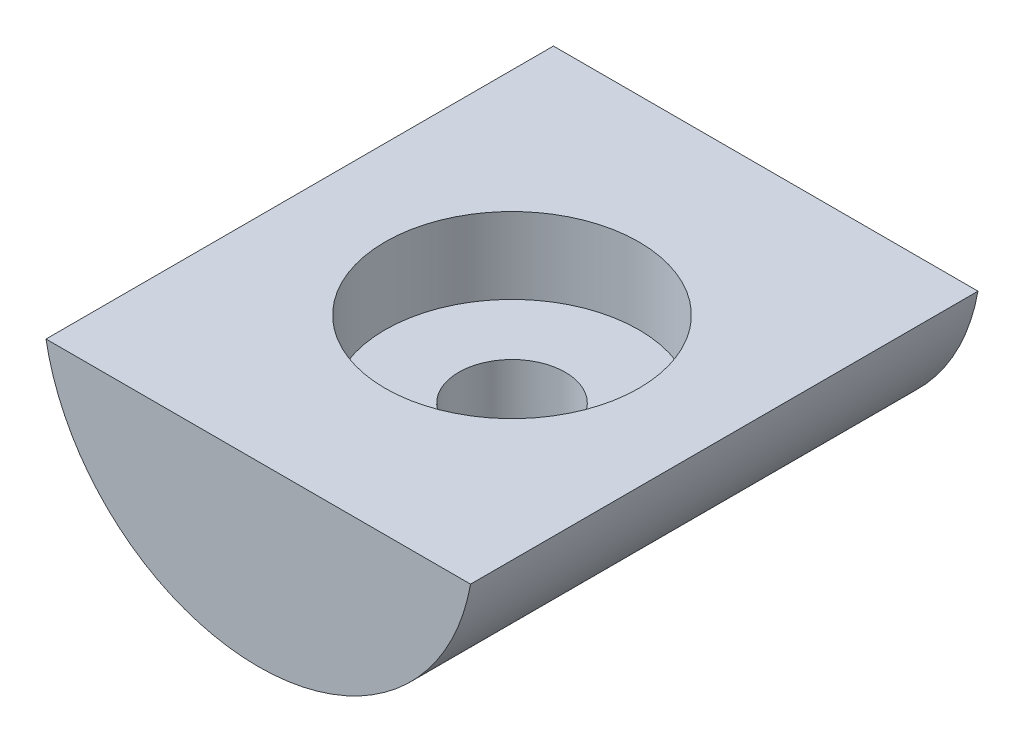
ISO-10303-21;
HEADER;
FILE_DESCRIPTION(('STEP AP214'),'2;1');
FILE_NAME('part.step','',(''),(''),'','','');
FILE_SCHEMA(('AUTOMOTIVE_DESIGN { 1 0 10303 214 1 1 1 1 }'));
ENDSEC;
DATA;
#1=APPLICATION_CONTEXT('core data for automotive mechanical design processes');
#2=APPLICATION_PROTOCOL_DEFINITION('international standard','automotive_design',2000,#1);
#3=PRODUCT_CONTEXT('',#1,'mechanical');
#4=PRODUCT('Part','Part','',(#3));
#5=PRODUCT_RELATED_PRODUCT_CATEGORY('part','',(#4));
#6=PRODUCT_DEFINITION_FORMATION('','',#4);
#7=PRODUCT_DEFINITION_CONTEXT('part definition',#1,'design');
#8=PRODUCT_DEFINITION('design','',#6,#7);
#9=PRODUCT_DEFINITION_SHAPE('','',#8);
#10=(LENGTH_UNIT() NAMED_UNIT(*) SI_UNIT(.MILLI.,.METRE.));
#11=(NAMED_UNIT(*) PLANE_ANGLE_UNIT() SI_UNIT($,.RADIAN.));
#12=(NAMED_UNIT(*) SI_UNIT($,.STERADIAN.) SOLID_ANGLE_UNIT());
#13=UNCERTAINTY_MEASURE_WITH_UNIT(LENGTH_MEASURE(1.E-05),#10,'distance_accuracy_value','');
#14=(GEOMETRIC_REPRESENTATION_CONTEXT(3) GLOBAL_UNCERTAINTY_ASSIGNED_CONTEXT((#13)) GLOBAL_UNIT_ASSIGNED_CONTEXT((#10,
#11,#12)) REPRESENTATION_CONTEXT('',''));
#15=CARTESIAN_POINT('',(0.,0.,0.));
#16=DIRECTION('',(0.,0.,1.));
#17=DIRECTION('',(1.,0.,0.));
#18=AXIS2_PLACEMENT_3D('',#15,#16,#17);
#19=CARTESIAN_POINT('',(0.,-8.5,10.));
#20=DIRECTION('',(0.,1.,0.));
#21=DIRECTION('',(0.,0.,1.));
#22=AXIS2_PLACEMENT_3D('',#19,#20,#21);
#23=CYLINDRICAL_SURFACE('',#22,2.1);
#24=CARTESIAN_POINT('',(0.,-8.5,12.1));
#25=CARTESIAN_POINT('',(0.116070693783538,-8.49999800918138,12.0999966640342));
#26=CARTESIAN_POINT('',(0.232178931507366,-8.49759878198986,12.0903444660549));
#27=CARTESIAN_POINT('',(0.461070671457287,-8.48826019005853,12.0520467520518));
#28=CARTESIAN_POINT('',(0.573852200824808,-8.48131818569408,12.0233901932303));
#29=CARTESIAN_POINT('',(0.792751820834902,-8.4636631789589,11.9480570829567));
#30=CARTESIAN_POINT('',(0.898877638825981,-8.4529546487778,11.9014018958688));
#31=CARTESIAN_POINT('',(1.101795889815,-8.42890856098788,11.7914703510539));
#32=CARTESIAN_POINT('',(1.19858806150874,-8.41557092980669,11.728193528173));
#33=CARTESIAN_POINT('',(1.38204204743677,-8.38741545366713,11.585467974397));
#34=CARTESIAN_POINT('',(1.46848899994257,-8.37257520158859,11.5057474737151));
#35=CARTESIAN_POINT('',(1.62693162811332,-8.34323680807366,11.3329795536443));
#36=CARTESIAN_POINT('',(1.69892570884804,-8.32873870455029,11.2399306653556));
#37=CARTESIAN_POINT('',(1.82742321348222,-8.30150075832169,11.0414868881181));
#38=CARTESIAN_POINT('',(1.88368744106863,-8.28878938984669,10.9359328504022));
#39=CARTESIAN_POINT('',(1.97759026550094,-8.26689043584017,10.7165000452202));
#40=CARTESIAN_POINT('',(2.01523176369654,-8.25770230145251,10.6026225776875));
#41=CARTESIAN_POINT('',(2.07008989778017,-8.24412023188701,10.3721350518398));
#42=CARTESIAN_POINT('',(2.0876922909958,-8.23963588576778,10.2556222578465));
#43=CARTESIAN_POINT('',(2.10317392244256,-8.23569841674094,10.0212177365091));
#44=CARTESIAN_POINT('',(2.10105628974613,-8.23624449563117,9.90332623089684));
#45=CARTESIAN_POINT('',(2.0774660222764,-8.24222484505404,9.6724582972594));
#46=CARTESIAN_POINT('',(2.05645188771728,-8.2475433130365,9.559431552464));
#47=CARTESIAN_POINT('',(1.99639604097165,-8.26228478094194,9.33855952410675));
#48=CARTESIAN_POINT('',(1.95735307129966,-8.27170806716753,9.23071460254905));
#49=CARTESIAN_POINT('',(1.86195414628767,-8.29370446491964,9.02203221236093));
#50=CARTESIAN_POINT('',(1.80543081547591,-8.30630780093839,8.92127457880254));
#51=CARTESIAN_POINT('',(1.6767927742621,-8.33322701442431,8.7305093168552));
#52=CARTESIAN_POINT('',(1.60467539444526,-8.34754318490962,8.64050353308576));
#53=CARTESIAN_POINT('',(1.4445162360684,-8.3767635143311,8.47116814656895));
#54=CARTESIAN_POINT('',(1.35608723477596,-8.3916729506971,8.39220524351945));
#55=CARTESIAN_POINT('',(1.16706456232543,-8.42004037693619,8.25016091569461));
#56=CARTESIAN_POINT('',(1.06647053662144,-8.43349832448445,8.18707995395877));
#57=CARTESIAN_POINT('',(0.855457643869528,-8.45751088439129,8.07845995149665));
#58=CARTESIAN_POINT('',(0.745007532215942,-8.46805579593392,8.03297932552909));
#59=CARTESIAN_POINT('',(0.517711266923943,-8.48498349628455,7.96133206492666));
#60=CARTESIAN_POINT('',(0.400866311702717,-8.49136706206861,7.93516182467731));
#61=CARTESIAN_POINT('',(0.167233380306472,-8.49913827042422,7.90343557739145));
#62=CARTESIAN_POINT('',(0.0505171631569313,-8.50064694690211,7.89738005263197));
#63=CARTESIAN_POINT('',(-0.182260721658087,-8.49884256411876,7.90468668977585));
#64=CARTESIAN_POINT('',(-0.298322445878949,-8.49552992808544,7.91804714729138));
#65=CARTESIAN_POINT('',(-0.524768996392018,-8.48453258186189,7.96339446719818));
#66=CARTESIAN_POINT('',(-0.635211561903025,-8.47691162844813,7.99510986232167));
#67=CARTESIAN_POINT('',(-0.849203770924829,-8.45815586843028,8.07595757012236));
#68=CARTESIAN_POINT('',(-0.952752726652835,-8.44702071184472,8.12509161759301));
#69=CARTESIAN_POINT('',(-1.1520135693382,-8.42218087597783,8.24035712857914));
#70=CARTESIAN_POINT('',(-1.24755754490001,-8.40843482092409,8.30676973305031));
#71=CARTESIAN_POINT('',(-1.42632231861542,-8.37996493851221,8.45434674373709));
#72=CARTESIAN_POINT('',(-1.5095410381837,-8.36524094683561,8.53551363305093));
#73=CARTESIAN_POINT('',(-1.66334338160458,-8.33604069535195,8.7126120957723));
#74=CARTESIAN_POINT('',(-1.73357700324382,-8.32157879479109,8.80885050145428));
#75=CARTESIAN_POINT('',(-1.85689585617096,-8.29493421645405,9.01204311150516));
#76=CARTESIAN_POINT('',(-1.90998185206615,-8.28275143706276,9.11899683780256));
#77=CARTESIAN_POINT('',(-1.99710541107696,-8.26217736387936,9.34000683901904));
#78=CARTESIAN_POINT('',(-2.03125583008345,-8.25376366543388,9.45401643123911));
#79=CARTESIAN_POINT('',(-2.0798403875698,-8.2416565457551,9.68639768473685));
#80=CARTESIAN_POINT('',(-2.09427871798651,-8.23796212094042,9.80476841308276));
#81=CARTESIAN_POINT('',(-2.10281410073504,-8.23578705986035,10.0389536785495));
#82=CARTESIAN_POINT('',(-2.09747007102311,-8.23716315917082,10.1547468440662));
#83=CARTESIAN_POINT('',(-2.06786865880553,-8.24464357771109,10.3837262433071));
#84=CARTESIAN_POINT('',(-2.04361163932659,-8.25074780618647,10.4969125270263));
#85=CARTESIAN_POINT('',(-1.97717474930079,-8.26691779751331,10.7168737807659));
#86=CARTESIAN_POINT('',(-1.93509738745015,-8.27696087867693,10.8236814940678));
#87=CARTESIAN_POINT('',(-1.83429576377406,-8.29988065646576,11.0287966495846));
#88=CARTESIAN_POINT('',(-1.77556924697779,-8.31275773687651,11.1271029380065));
#89=CARTESIAN_POINT('',(-1.64137406248712,-8.34030506654025,11.3151310526573));
#90=CARTESIAN_POINT('',(-1.56551650902379,-8.35501268049769,11.4045699051821));
#91=CARTESIAN_POINT('',(-1.39997348106837,-8.38433823620064,11.5696306798008));
#92=CARTESIAN_POINT('',(-1.31028473900064,-8.39895615590543,11.6452493276655));
#93=CARTESIAN_POINT('',(-1.11772312624881,-8.42676166757186,11.781816767243));
#94=CARTESIAN_POINT('',(-1.01464627268259,-8.43991961118844,11.8424844223904));
#95=CARTESIAN_POINT('',(-0.799442190601992,-8.46301158765902,11.9455339346769));
#96=CARTESIAN_POINT('',(-0.687321631029137,-8.47294796947706,11.987929122434));
#97=CARTESIAN_POINT('',(-0.479472865974572,-8.48697753544662,12.0468094826398));
#98=CARTESIAN_POINT('',(-0.384749523490453,-8.49182775309005,12.0667133365776));
#99=CARTESIAN_POINT('',(-0.193359379012435,-8.4983397003884,12.0933095115641));
#100=CARTESIAN_POINT('',(-0.0966927167403746,-8.50000165845189,12.100002779027));
#101=CARTESIAN_POINT('',(0.,-8.5,12.1));
#102=B_SPLINE_CURVE_WITH_KNOTS('',3,(#24,#25,#26,#27,#28,#29,#30,#31,#32,#33,#34,#35,#36,#37,
#38,#39,#40,#41,#42,#43,#44,#45,#46,#47,#48,#49,#50,#51,#52,#53,#54,#55,#56,#57,#58,#59,#60,#61,
#62,#63,#64,#65,#66,#67,#68,#69,#70,#71,#72,#73,#74,#75,#76,#77,#78,#79,#80,#81,#82,#83,#84,#85,
#86,#87,#88,#89,#90,#91,#92,#93,#94,#95,#96,#97,#98,#99,#100,#101),.UNSPECIFIED.,.T.,.F.,(4,2,2,
2,2,2,2,2,2,2,2,2,2,2,2,2,2,2,2,2,2,2,2,2,2,2,2,2,2,2,2,2,2,2,2,2,2,2,4),(0.,0.347857779951649,
0.695917865723665,1.04356606924931,1.39122400268944,1.74516924484556,2.09915352478134,
2.45825939977015,2.81730930981123,3.16932391857982,3.52128267243011,3.86492538124193,
4.20859206226294,4.5556569609785,4.90278131793042,5.25956329749736,5.6163556778723,
5.97432228356676,6.33222203319573,6.68116468034582,7.03007669820962,7.37395563589729,
7.71786883149361,8.06777200521294,8.41773412111266,8.77607061137682,9.13439112132212,
9.4905524360692,9.84663799839616,10.192740734927,10.5388368283283,10.8829685353473,
11.2271468740422,11.5801054618945,11.9331475632288,12.2923934974479,12.6513768995255,
12.9411806613562,13.2309636607197),.UNSPECIFIED.);
#103=CARTESIAN_POINT('',(0.,-8.5,12.1));
#104=VERTEX_POINT('',#103);
#105=EDGE_CURVE('E75',#104,#104,#102,.T.);
#106=ORIENTED_EDGE('',*,*,#105,.F.);
#107=EDGE_LOOP('',(#106));
#108=FACE_BOUND('',#107,.T.);
#109=CARTESIAN_POINT('',(0.,-4.5,10.));
#110=DIRECTION('',(0.,1.,0.));
#111=DIRECTION('',(0.,0.,1.));
#112=AXIS2_PLACEMENT_3D('',#109,#110,#111);
#113=CIRCLE('',#112,2.1);
#114=CARTESIAN_POINT('',(0.,-4.5,12.1));
#115=VERTEX_POINT('',#114);
#116=EDGE_CURVE('E41',#115,#115,#113,.F.);
#117=ORIENTED_EDGE('',*,*,#116,.F.);
#118=EDGE_LOOP('',(#117));
#119=FACE_BOUND('',#118,.T.);
#120=ADVANCED_FACE('F36',(#108,#119),#23,.F.);
#121=CARTESIAN_POINT('',(0.,0.,20.));
#122=DIRECTION('',(0.,0.,-1.));
#123=DIRECTION('',(-1.,0.,0.));
#124=AXIS2_PLACEMENT_3D('',#121,#122,#123);
#125=CYLINDRICAL_SURFACE('',#124,8.5);
#126=ORIENTED_EDGE('',*,*,#105,.T.);
#127=EDGE_LOOP('',(#126));
#128=FACE_BOUND('',#127,.T.);
#129=CARTESIAN_POINT('',(0.,0.,0.));
#130=DIRECTION('',(0.,0.,1.));
#131=DIRECTION('',(1.,0.,0.));
#132=AXIS2_PLACEMENT_3D('',#129,#130,#131);
#133=CIRCLE('',#132,8.5);
#134=CARTESIAN_POINT('',(-8.36660026534076,-1.5,0.));
#135=VERTEX_POINT('',#134);
#136=CARTESIAN_POINT('',(8.36660026534076,-1.5,0.));
#137=VERTEX_POINT('',#136);
#138=EDGE_CURVE('E70',#135,#137,#133,.T.);
#139=ORIENTED_EDGE('',*,*,#138,.T.);
#140=DIRECTION('',(0.,0.,-1.));
#141=VECTOR('',#140,1.);
#142=CARTESIAN_POINT('',(8.36660026534076,-1.5,20.));
#143=LINE('',#142,#141);
#144=CARTESIAN_POINT('',(8.36660026534076,-1.5,20.));
#145=VERTEX_POINT('',#144);
#146=EDGE_CURVE('E11',#145,#137,#143,.T.);
#147=ORIENTED_EDGE('',*,*,#146,.F.);
#148=CARTESIAN_POINT('',(0.,0.,20.));
#149=DIRECTION('',(0.,0.,1.));
#150=DIRECTION('',(1.,0.,0.));
#151=AXIS2_PLACEMENT_3D('',#148,#149,#150);
#152=CIRCLE('',#151,8.5);
#153=CARTESIAN_POINT('',(-8.36660026534076,-1.5,20.));
#154=VERTEX_POINT('',#153);
#155=EDGE_CURVE('E69',#154,#145,#152,.T.);
#156=ORIENTED_EDGE('',*,*,#155,.F.);
#157=DIRECTION('',(0.,0.,-1.));
#158=VECTOR('',#157,1.);
#159=CARTESIAN_POINT('',(-8.36660026534076,-1.5,20.));
#160=LINE('',#159,#158);
#161=EDGE_CURVE('E47',#154,#135,#160,.T.);
#162=ORIENTED_EDGE('',*,*,#161,.T.);
#163=EDGE_LOOP('',(#139,#147,#156,#162));
#164=FACE_BOUND('',#163,.T.);
#165=ADVANCED_FACE('F38',(#128,#164),#125,.T.);
#166=CARTESIAN_POINT('',(-8.36660026534076,-1.5,20.));
#167=DIRECTION('',(0.,-1.,0.));
#168=DIRECTION('',(0.,0.,-1.));
#169=AXIS2_PLACEMENT_3D('',#166,#167,#168);
#170=PLANE('',#169);
#171=CARTESIAN_POINT('',(0.,-1.5,10.));
#172=DIRECTION('',(0.,1.,0.));
#173=DIRECTION('',(0.,0.,1.));
#174=AXIS2_PLACEMENT_3D('',#171,#172,#173);
#175=CIRCLE('',#174,5.);
#176=CARTESIAN_POINT('',(0.,-1.5,15.));
#177=VERTEX_POINT('',#176);
#178=EDGE_CURVE('E86',#177,#177,#175,.T.);
#179=ORIENTED_EDGE('',*,*,#178,.F.);
#180=EDGE_LOOP('',(#179));
#181=FACE_BOUND('',#180,.T.);
#182=DIRECTION('',(-1.,0.,0.));
#183=VECTOR('',#182,1.);
#184=CARTESIAN_POINT('',(-8.36660026534076,-1.5,0.));
#185=LINE('',#184,#183);
#186=EDGE_CURVE('E62',#137,#135,#185,.T.);
#187=ORIENTED_EDGE('',*,*,#186,.T.);
#188=ORIENTED_EDGE('',*,*,#161,.F.);
#189=DIRECTION('',(-1.,0.,0.));
#190=VECTOR('',#189,1.);
#191=CARTESIAN_POINT('',(-8.36660026534076,-1.5,20.));
#192=LINE('',#191,#190);
#193=EDGE_CURVE('E54',#145,#154,#192,.T.);
#194=ORIENTED_EDGE('',*,*,#193,.F.);
#195=ORIENTED_EDGE('',*,*,#146,.T.);
#196=EDGE_LOOP('',(#187,#188,#194,#195));
#197=FACE_BOUND('',#196,.T.);
#198=ADVANCED_FACE('F65',(#181,#197),#170,.F.);
#199=CARTESIAN_POINT('',(0.,0.,20.));
#200=DIRECTION('',(0.,0.,1.));
#201=DIRECTION('',(1.,0.,0.));
#202=AXIS2_PLACEMENT_3D('',#199,#200,#201);
#203=PLANE('',#202);
#204=ORIENTED_EDGE('',*,*,#155,.T.);
#205=ORIENTED_EDGE('',*,*,#193,.T.);
#206=EDGE_LOOP('',(#204,#205));
#207=FACE_BOUND('',#206,.T.);
#208=ADVANCED_FACE('F95',(#207),#203,.T.);
#209=CARTESIAN_POINT('',(0.,0.,0.));
#210=DIRECTION('',(0.,0.,1.));
#211=DIRECTION('',(1.,0.,0.));
#212=AXIS2_PLACEMENT_3D('',#209,#210,#211);
#213=PLANE('',#212);
#214=ORIENTED_EDGE('',*,*,#138,.F.);
#215=ORIENTED_EDGE('',*,*,#186,.F.);
#216=EDGE_LOOP('',(#214,#215));
#217=FACE_BOUND('',#216,.T.);
#218=ADVANCED_FACE('F74',(#217),#213,.F.);
#219=CARTESIAN_POINT('',(0.,-4.5,10.));
#220=DIRECTION('',(0.,1.,0.));
#221=DIRECTION('',(0.,0.,1.));
#222=AXIS2_PLACEMENT_3D('',#219,#220,#221);
#223=PLANE('',#222);
#224=CARTESIAN_POINT('',(0.,-4.5,10.));
#225=DIRECTION('',(0.,1.,0.));
#226=DIRECTION('',(0.,0.,1.));
#227=AXIS2_PLACEMENT_3D('',#224,#225,#226);
#228=CIRCLE('',#227,5.);
#229=CARTESIAN_POINT('',(0.,-4.5,15.));
#230=VERTEX_POINT('',#229);
#231=EDGE_CURVE('E109',#230,#230,#228,.T.);
#232=ORIENTED_EDGE('',*,*,#231,.T.);
#233=EDGE_LOOP('',(#232));
#234=FACE_BOUND('',#233,.T.);
#235=ORIENTED_EDGE('',*,*,#116,.T.);
#236=EDGE_LOOP('',(#235));
#237=FACE_BOUND('',#236,.T.);
#238=ADVANCED_FACE('F99',(#234,#237),#223,.T.);
#239=CARTESIAN_POINT('',(0.,-4.5,10.));
#240=DIRECTION('',(0.,1.,0.));
#241=DIRECTION('',(0.,0.,1.));
#242=AXIS2_PLACEMENT_3D('',#239,#240,#241);
#243=CYLINDRICAL_SURFACE('',#242,5.);
#244=ORIENTED_EDGE('',*,*,#231,.F.);
#245=EDGE_LOOP('',(#244));
#246=FACE_BOUND('',#245,.T.);
#247=ORIENTED_EDGE('',*,*,#178,.T.);
#248=EDGE_LOOP('',(#247));
#249=FACE_BOUND('',#248,.T.);
#250=ADVANCED_FACE('F93',(#246,#249),#243,.F.);
#251=CLOSED_SHELL('',(#120,#165,#198,#208,#218,#238,#250));
#252=MANIFOLD_SOLID_BREP('B2',#251);
#253=ADVANCED_BREP_SHAPE_REPRESENTATION('',(#18,#252),#14);
#254=SHAPE_DEFINITION_REPRESENTATION(#9,#253);
ENDSEC;
END-ISO-10303-21;
